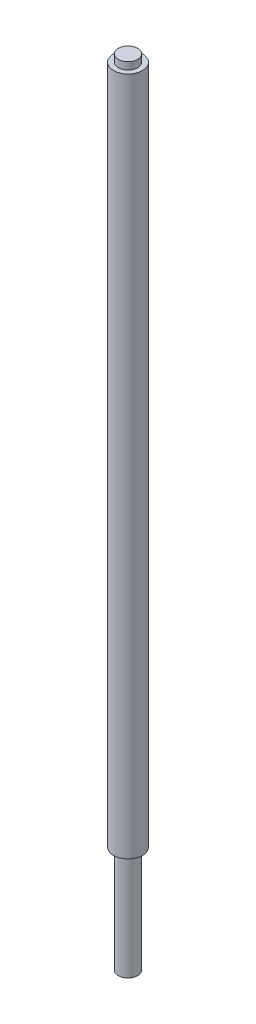
ISO-10303-21;
HEADER;
FILE_DESCRIPTION(('STEP AP214'),'2;1');
FILE_NAME('part.step','',(''),(''),'','','');
FILE_SCHEMA(('AUTOMOTIVE_DESIGN { 1 0 10303 214 1 1 1 1 }'));
ENDSEC;
DATA;
#1=APPLICATION_CONTEXT('core data for automotive mechanical design processes');
#2=APPLICATION_PROTOCOL_DEFINITION('international standard','automotive_design',2000,#1);
#3=PRODUCT_CONTEXT('',#1,'mechanical');
#4=PRODUCT('Part','Part','',(#3));
#5=PRODUCT_RELATED_PRODUCT_CATEGORY('part','',(#4));
#6=PRODUCT_DEFINITION_FORMATION('','',#4);
#7=PRODUCT_DEFINITION_CONTEXT('part definition',#1,'design');
#8=PRODUCT_DEFINITION('design','',#6,#7);
#9=PRODUCT_DEFINITION_SHAPE('','',#8);
#10=(LENGTH_UNIT() NAMED_UNIT(*) SI_UNIT(.MILLI.,.METRE.));
#11=(NAMED_UNIT(*) PLANE_ANGLE_UNIT() SI_UNIT($,.RADIAN.));
#12=(NAMED_UNIT(*) SI_UNIT($,.STERADIAN.) SOLID_ANGLE_UNIT());
#13=UNCERTAINTY_MEASURE_WITH_UNIT(LENGTH_MEASURE(1.E-05),#10,'distance_accuracy_value','');
#14=(GEOMETRIC_REPRESENTATION_CONTEXT(3) GLOBAL_UNCERTAINTY_ASSIGNED_CONTEXT((#13)) GLOBAL_UNIT_ASSIGNED_CONTEXT((#10,
#11,#12)) REPRESENTATION_CONTEXT('',''));
#15=CARTESIAN_POINT('',(0.,0.,0.));
#16=DIRECTION('',(0.,0.,1.));
#17=DIRECTION('',(1.,0.,0.));
#18=AXIS2_PLACEMENT_3D('',#15,#16,#17);
#19=CARTESIAN_POINT('',(0.,329.2,0.));
#20=DIRECTION('',(0.,-1.,0.));
#21=DIRECTION('',(0.,0.,-1.));
#22=AXIS2_PLACEMENT_3D('',#19,#20,#21);
#23=CYLINDRICAL_SURFACE('',#22,4.);
#24=CARTESIAN_POINT('',(0.,0.,0.));
#25=DIRECTION('',(0.,1.,0.));
#26=DIRECTION('',(0.,0.,1.));
#27=AXIS2_PLACEMENT_3D('',#24,#25,#26);
#28=CIRCLE('',#27,4.);
#29=CARTESIAN_POINT('',(0.,0.,4.));
#30=VERTEX_POINT('',#29);
#31=EDGE_CURVE('E51',#30,#30,#28,.T.);
#32=ORIENTED_EDGE('',*,*,#31,.T.);
#33=EDGE_LOOP('',(#32));
#34=FACE_BOUND('',#33,.T.);
#35=CARTESIAN_POINT('',(0.,44.2,0.));
#36=DIRECTION('',(0.,1.,0.));
#37=DIRECTION('',(0.,0.,1.));
#38=AXIS2_PLACEMENT_3D('',#35,#36,#37);
#39=CIRCLE('',#38,4.);
#40=CARTESIAN_POINT('',(0.,44.2,4.));
#41=VERTEX_POINT('',#40);
#42=EDGE_CURVE('E10',#41,#41,#39,.T.);
#43=ORIENTED_EDGE('',*,*,#42,.F.);
#44=EDGE_LOOP('',(#43));
#45=FACE_BOUND('',#44,.T.);
#46=ADVANCED_FACE('F40',(#34,#45),#23,.T.);
#47=CARTESIAN_POINT('',(0.,0.,0.));
#48=DIRECTION('',(0.,1.,0.));
#49=DIRECTION('',(0.,0.,1.));
#50=AXIS2_PLACEMENT_3D('',#47,#48,#49);
#51=PLANE('',#50);
#52=ORIENTED_EDGE('',*,*,#31,.F.);
#53=EDGE_LOOP('',(#52));
#54=FACE_BOUND('',#53,.T.);
#55=ADVANCED_FACE('F120',(#54),#51,.F.);
#56=CARTESIAN_POINT('',(0.,44.2,0.));
#57=DIRECTION('',(0.,1.,0.));
#58=DIRECTION('',(0.,0.,1.));
#59=AXIS2_PLACEMENT_3D('',#56,#57,#58);
#60=CYLINDRICAL_SURFACE('',#59,6.);
#61=CARTESIAN_POINT('',(0.,44.2,0.));
#62=DIRECTION('',(0.,1.,0.));
#63=DIRECTION('',(0.,0.,1.));
#64=AXIS2_PLACEMENT_3D('',#61,#62,#63);
#65=CIRCLE('',#64,6.);
#66=CARTESIAN_POINT('',(0.,44.2,6.));
#67=VERTEX_POINT('',#66);
#68=EDGE_CURVE('E62',#67,#67,#65,.T.);
#69=ORIENTED_EDGE('',*,*,#68,.T.);
#70=EDGE_LOOP('',(#69));
#71=FACE_BOUND('',#70,.T.);
#72=CARTESIAN_POINT('',(0.,326.2,0.));
#73=DIRECTION('',(0.,1.,0.));
#74=DIRECTION('',(0.,0.,1.));
#75=AXIS2_PLACEMENT_3D('',#72,#73,#74);
#76=CIRCLE('',#75,6.);
#77=CARTESIAN_POINT('',(0.,326.2,6.));
#78=VERTEX_POINT('',#77);
#79=EDGE_CURVE('E59',#78,#78,#76,.T.);
#80=ORIENTED_EDGE('',*,*,#79,.F.);
#81=EDGE_LOOP('',(#80));
#82=FACE_BOUND('',#81,.T.);
#83=ADVANCED_FACE('F113',(#71,#82),#60,.T.);
#84=CARTESIAN_POINT('',(0.,44.2,0.));
#85=DIRECTION('',(0.,1.,0.));
#86=DIRECTION('',(0.,0.,1.));
#87=AXIS2_PLACEMENT_3D('',#84,#85,#86);
#88=PLANE('',#87);
#89=ORIENTED_EDGE('',*,*,#42,.T.);
#90=EDGE_LOOP('',(#89));
#91=FACE_BOUND('',#90,.T.);
#92=ORIENTED_EDGE('',*,*,#68,.F.);
#93=EDGE_LOOP('',(#92));
#94=FACE_BOUND('',#93,.T.);
#95=ADVANCED_FACE('F109',(#91,#94),#88,.F.);
#96=CARTESIAN_POINT('',(0.,326.2,0.));
#97=DIRECTION('',(0.,1.,0.));
#98=DIRECTION('',(0.,0.,1.));
#99=AXIS2_PLACEMENT_3D('',#96,#97,#98);
#100=PLANE('',#99);
#101=CARTESIAN_POINT('',(0.,326.2,0.));
#102=DIRECTION('',(0.,1.,0.));
#103=DIRECTION('',(0.,0.,1.));
#104=AXIS2_PLACEMENT_3D('',#101,#102,#103);
#105=CIRCLE('',#104,4.);
#106=CARTESIAN_POINT('',(0.,326.2,4.));
#107=VERTEX_POINT('',#106);
#108=EDGE_CURVE('E56',#107,#107,#105,.T.);
#109=ORIENTED_EDGE('',*,*,#108,.F.);
#110=EDGE_LOOP('',(#109));
#111=FACE_BOUND('',#110,.T.);
#112=ORIENTED_EDGE('',*,*,#79,.T.);
#113=EDGE_LOOP('',(#112));
#114=FACE_BOUND('',#113,.T.);
#115=ADVANCED_FACE('F112',(#111,#114),#100,.T.);
#116=CARTESIAN_POINT('',(0.,329.2,0.));
#117=DIRECTION('',(0.,1.,0.));
#118=DIRECTION('',(0.,0.,1.));
#119=AXIS2_PLACEMENT_3D('',#116,#117,#118);
#120=PLANE('',#119);
#121=CARTESIAN_POINT('',(0.,329.2,0.));
#122=DIRECTION('',(0.,1.,0.));
#123=DIRECTION('',(0.,0.,1.));
#124=AXIS2_PLACEMENT_3D('',#121,#122,#123);
#125=CIRCLE('',#124,4.);
#126=CARTESIAN_POINT('',(0.,329.2,4.));
#127=VERTEX_POINT('',#126);
#128=EDGE_CURVE('E47',#127,#127,#125,.T.);
#129=ORIENTED_EDGE('',*,*,#128,.T.);
#130=EDGE_LOOP('',(#129));
#131=FACE_BOUND('',#130,.T.);
#132=ADVANCED_FACE('F116',(#131),#120,.T.);
#133=ORIENTED_EDGE('',*,*,#108,.T.);
#134=EDGE_LOOP('',(#133));
#135=FACE_BOUND('',#134,.T.);
#136=ORIENTED_EDGE('',*,*,#128,.F.);
#137=EDGE_LOOP('',(#136));
#138=FACE_BOUND('',#137,.T.);
#139=ADVANCED_FACE('F42',(#135,#138),#23,.T.);
#140=CLOSED_SHELL('',(#46,#55,#83,#95,#115,#132,#139));
#141=CARTESIAN_POINT('',(0.,259.2,0.));
#142=DIRECTION('',(0.,1.,0.));
#143=DIRECTION('',(0.,0.,1.));
#144=AXIS2_PLACEMENT_3D('',#141,#142,#143);
#145=CYLINDRICAL_SURFACE('',#144,5.);
#146=CARTESIAN_POINT('',(0.,259.2,0.));
#147=DIRECTION('',(0.,1.,0.));
#148=DIRECTION('',(0.,0.,1.));
#149=AXIS2_PLACEMENT_3D('',#146,#147,#148);
#150=CIRCLE('',#149,5.);
#151=CARTESIAN_POINT('',(0.,259.2,5.));
#152=VERTEX_POINT('',#151);
#153=EDGE_CURVE('E69',#152,#152,#150,.T.);
#154=ORIENTED_EDGE('',*,*,#153,.F.);
#155=EDGE_LOOP('',(#154));
#156=FACE_BOUND('',#155,.T.);
#157=CARTESIAN_POINT('',(0.,289.2,0.));
#158=DIRECTION('',(0.,1.,0.));
#159=DIRECTION('',(0.,0.,1.));
#160=AXIS2_PLACEMENT_3D('',#157,#158,#159);
#161=CIRCLE('',#160,5.);
#162=CARTESIAN_POINT('',(0.,289.2,5.));
#163=VERTEX_POINT('',#162);
#164=EDGE_CURVE('E71',#163,#163,#161,.T.);
#165=ORIENTED_EDGE('',*,*,#164,.T.);
#166=EDGE_LOOP('',(#165));
#167=FACE_BOUND('',#166,.T.);
#168=ADVANCED_FACE('F90',(#156,#167),#145,.F.);
#169=CARTESIAN_POINT('',(0.,259.2,0.));
#170=DIRECTION('',(0.,1.,0.));
#171=DIRECTION('',(0.,0.,1.));
#172=AXIS2_PLACEMENT_3D('',#169,#170,#171);
#173=PLANE('',#172);
#174=CARTESIAN_POINT('',(0.,259.2,0.));
#175=DIRECTION('',(0.,1.,0.));
#176=DIRECTION('',(0.,0.,1.));
#177=AXIS2_PLACEMENT_3D('',#174,#175,#176);
#178=CIRCLE('',#177,4.);
#179=CARTESIAN_POINT('',(0.,259.2,4.));
#180=VERTEX_POINT('',#179);
#181=EDGE_CURVE('E74',#180,#180,#178,.T.);
#182=ORIENTED_EDGE('',*,*,#181,.F.);
#183=EDGE_LOOP('',(#182));
#184=FACE_BOUND('',#183,.T.);
#185=ORIENTED_EDGE('',*,*,#153,.T.);
#186=EDGE_LOOP('',(#185));
#187=FACE_BOUND('',#186,.T.);
#188=ADVANCED_FACE('F86',(#184,#187),#173,.T.);
#189=CARTESIAN_POINT('',(0.,289.2,0.));
#190=DIRECTION('',(0.,1.,0.));
#191=DIRECTION('',(0.,0.,1.));
#192=AXIS2_PLACEMENT_3D('',#189,#190,#191);
#193=PLANE('',#192);
#194=CARTESIAN_POINT('',(0.,289.2,0.));
#195=DIRECTION('',(0.,1.,0.));
#196=DIRECTION('',(0.,0.,1.));
#197=AXIS2_PLACEMENT_3D('',#194,#195,#196);
#198=CIRCLE('',#197,4.);
#199=CARTESIAN_POINT('',(0.,289.2,4.));
#200=VERTEX_POINT('',#199);
#201=EDGE_CURVE('E77',#200,#200,#198,.T.);
#202=ORIENTED_EDGE('',*,*,#201,.T.);
#203=EDGE_LOOP('',(#202));
#204=FACE_BOUND('',#203,.T.);
#205=ORIENTED_EDGE('',*,*,#164,.F.);
#206=EDGE_LOOP('',(#205));
#207=FACE_BOUND('',#206,.T.);
#208=ADVANCED_FACE('F89',(#204,#207),#193,.F.);
#209=CARTESIAN_POINT('',(0.,259.2,0.));
#210=DIRECTION('',(0.,1.,0.));
#211=DIRECTION('',(0.,0.,1.));
#212=AXIS2_PLACEMENT_3D('',#209,#210,#211);
#213=CYLINDRICAL_SURFACE('',#212,4.);
#214=ORIENTED_EDGE('',*,*,#181,.T.);
#215=EDGE_LOOP('',(#214));
#216=FACE_BOUND('',#215,.T.);
#217=ORIENTED_EDGE('',*,*,#201,.F.);
#218=EDGE_LOOP('',(#217));
#219=FACE_BOUND('',#218,.T.);
#220=ADVANCED_FACE('F83',(#216,#219),#213,.T.);
#221=CLOSED_SHELL('',(#168,#188,#208,#220));
#222=ORIENTED_CLOSED_SHELL('',*,#221,.T.);
#223=BREP_WITH_VOIDS('B2',#140,(#222));
#224=ADVANCED_BREP_SHAPE_REPRESENTATION('',(#18,#223),#14);
#225=SHAPE_DEFINITION_REPRESENTATION(#9,#224);
ENDSEC;
END-ISO-10303-21;
